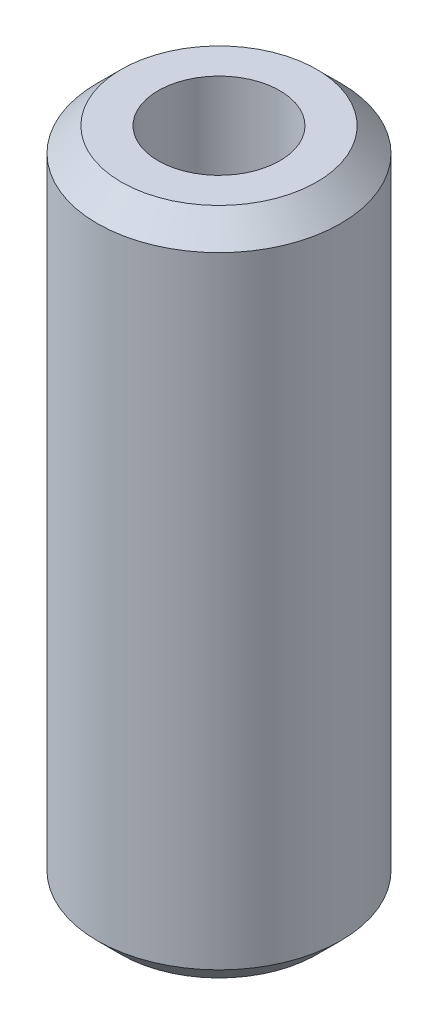
ISO-10303-21;
HEADER;
FILE_DESCRIPTION(('STEP AP214'),'2;1');
FILE_NAME('part.step','',(''),(''),'','','');
FILE_SCHEMA(('AUTOMOTIVE_DESIGN { 1 0 10303 214 1 1 1 1 }'));
ENDSEC;
DATA;
#1=APPLICATION_CONTEXT('core data for automotive mechanical design processes');
#2=APPLICATION_PROTOCOL_DEFINITION('international standard','automotive_design',2000,#1);
#3=PRODUCT_CONTEXT('',#1,'mechanical');
#4=PRODUCT('Part','Part','',(#3));
#5=PRODUCT_RELATED_PRODUCT_CATEGORY('part','',(#4));
#6=PRODUCT_DEFINITION_FORMATION('','',#4);
#7=PRODUCT_DEFINITION_CONTEXT('part definition',#1,'design');
#8=PRODUCT_DEFINITION('design','',#6,#7);
#9=PRODUCT_DEFINITION_SHAPE('','',#8);
#10=(LENGTH_UNIT() NAMED_UNIT(*) SI_UNIT(.MILLI.,.METRE.));
#11=(NAMED_UNIT(*) PLANE_ANGLE_UNIT() SI_UNIT($,.RADIAN.));
#12=(NAMED_UNIT(*) SI_UNIT($,.STERADIAN.) SOLID_ANGLE_UNIT());
#13=UNCERTAINTY_MEASURE_WITH_UNIT(LENGTH_MEASURE(1.E-05),#10,'distance_accuracy_value','');
#14=(GEOMETRIC_REPRESENTATION_CONTEXT(3) GLOBAL_UNCERTAINTY_ASSIGNED_CONTEXT((#13)) GLOBAL_UNIT_ASSIGNED_CONTEXT((#10,
#11,#12)) REPRESENTATION_CONTEXT('',''));
#15=CARTESIAN_POINT('',(0.,0.,0.));
#16=DIRECTION('',(0.,0.,1.));
#17=DIRECTION('',(1.,0.,0.));
#18=AXIS2_PLACEMENT_3D('',#15,#16,#17);
#19=CARTESIAN_POINT('',(0.,34.925,0.));
#20=DIRECTION('',(0.,1.,0.));
#21=DIRECTION('',(0.,0.,1.));
#22=AXIS2_PLACEMENT_3D('',#19,#20,#21);
#23=PLANE('',#22);
#24=CARTESIAN_POINT('',(0.,34.925,0.));
#25=DIRECTION('',(0.,1.,0.));
#26=DIRECTION('',(0.,0.,1.));
#27=AXIS2_PLACEMENT_3D('',#24,#25,#26);
#28=CIRCLE('',#27,10.2);
#29=CARTESIAN_POINT('',(0.,34.925,10.2));
#30=VERTEX_POINT('',#29);
#31=EDGE_CURVE('E10',#30,#30,#28,.T.);
#32=ORIENTED_EDGE('',*,*,#31,.T.);
#33=EDGE_LOOP('',(#32));
#34=FACE_BOUND('',#33,.T.);
#35=CARTESIAN_POINT('',(0.,34.925,0.));
#36=DIRECTION('',(0.,1.,0.));
#37=DIRECTION('',(0.,0.,1.));
#38=AXIS2_PLACEMENT_3D('',#35,#36,#37);
#39=CIRCLE('',#38,6.35);
#40=CARTESIAN_POINT('',(0.,34.925,6.35));
#41=VERTEX_POINT('',#40);
#42=EDGE_CURVE('E51',#41,#41,#39,.T.);
#43=ORIENTED_EDGE('',*,*,#42,.F.);
#44=EDGE_LOOP('',(#43));
#45=FACE_BOUND('',#44,.T.);
#46=ADVANCED_FACE('F31',(#34,#45),#23,.T.);
#47=CARTESIAN_POINT('',(0.,-34.925,0.));
#48=DIRECTION('',(0.,1.,0.));
#49=DIRECTION('',(0.,0.,1.));
#50=AXIS2_PLACEMENT_3D('',#47,#48,#49);
#51=PLANE('',#50);
#52=CARTESIAN_POINT('',(0.,-34.925,0.));
#53=DIRECTION('',(0.,1.,0.));
#54=DIRECTION('',(0.,0.,1.));
#55=AXIS2_PLACEMENT_3D('',#52,#53,#54);
#56=CIRCLE('',#55,10.2);
#57=CARTESIAN_POINT('',(0.,-34.925,10.2));
#58=VERTEX_POINT('',#57);
#59=EDGE_CURVE('E38',#58,#58,#56,.F.);
#60=ORIENTED_EDGE('',*,*,#59,.T.);
#61=EDGE_LOOP('',(#60));
#62=FACE_BOUND('',#61,.T.);
#63=CARTESIAN_POINT('',(0.,-34.925,0.));
#64=DIRECTION('',(0.,1.,0.));
#65=DIRECTION('',(0.,0.,1.));
#66=AXIS2_PLACEMENT_3D('',#63,#64,#65);
#67=CIRCLE('',#66,6.35);
#68=CARTESIAN_POINT('',(0.,-34.925,6.35));
#69=VERTEX_POINT('',#68);
#70=EDGE_CURVE('E52',#69,#69,#67,.T.);
#71=ORIENTED_EDGE('',*,*,#70,.T.);
#72=EDGE_LOOP('',(#71));
#73=FACE_BOUND('',#72,.T.);
#74=ADVANCED_FACE('F62',(#62,#73),#51,.F.);
#75=CARTESIAN_POINT('',(0.,34.925,0.));
#76=DIRECTION('',(0.,-1.,0.));
#77=DIRECTION('',(0.,0.,-1.));
#78=AXIS2_PLACEMENT_3D('',#75,#76,#77);
#79=CYLINDRICAL_SURFACE('',#78,12.7);
#80=CARTESIAN_POINT('',(0.,-32.425,0.));
#81=DIRECTION('',(0.,1.,0.));
#82=DIRECTION('',(0.,0.,1.));
#83=AXIS2_PLACEMENT_3D('',#80,#81,#82);
#84=CIRCLE('',#83,12.7);
#85=CARTESIAN_POINT('',(0.,-32.425,12.7));
#86=VERTEX_POINT('',#85);
#87=EDGE_CURVE('E42',#86,#86,#84,.T.);
#88=ORIENTED_EDGE('',*,*,#87,.T.);
#89=EDGE_LOOP('',(#88));
#90=FACE_BOUND('',#89,.T.);
#91=CARTESIAN_POINT('',(0.,32.425,0.));
#92=DIRECTION('',(0.,1.,0.));
#93=DIRECTION('',(0.,0.,1.));
#94=AXIS2_PLACEMENT_3D('',#91,#92,#93);
#95=CIRCLE('',#94,12.7);
#96=CARTESIAN_POINT('',(0.,32.425,12.7));
#97=VERTEX_POINT('',#96);
#98=EDGE_CURVE('E46',#97,#97,#95,.F.);
#99=ORIENTED_EDGE('',*,*,#98,.T.);
#100=EDGE_LOOP('',(#99));
#101=FACE_BOUND('',#100,.T.);
#102=ADVANCED_FACE('F67',(#90,#101),#79,.T.);
#103=CARTESIAN_POINT('',(0.,34.925,0.));
#104=DIRECTION('',(0.,-1.,0.));
#105=DIRECTION('',(0.,0.,-1.));
#106=AXIS2_PLACEMENT_3D('',#103,#104,#105);
#107=CYLINDRICAL_SURFACE('',#106,6.35);
#108=ORIENTED_EDGE('',*,*,#42,.T.);
#109=EDGE_LOOP('',(#108));
#110=FACE_BOUND('',#109,.T.);
#111=ORIENTED_EDGE('',*,*,#70,.F.);
#112=EDGE_LOOP('',(#111));
#113=FACE_BOUND('',#112,.T.);
#114=ADVANCED_FACE('F58',(#110,#113),#107,.F.);
#115=CARTESIAN_POINT('',(0.,-32.425,0.));
#116=DIRECTION('',(0.,1.,0.));
#117=DIRECTION('',(0.,0.,1.));
#118=AXIS2_PLACEMENT_3D('',#115,#116,#117);
#119=CONICAL_SURFACE('',#118,12.7,0.785398163397449);
#120=ORIENTED_EDGE('',*,*,#59,.F.);
#121=EDGE_LOOP('',(#120));
#122=FACE_BOUND('',#121,.T.);
#123=ORIENTED_EDGE('',*,*,#87,.F.);
#124=EDGE_LOOP('',(#123));
#125=FACE_BOUND('',#124,.T.);
#126=ADVANCED_FACE('F73',(#122,#125),#119,.T.);
#127=CARTESIAN_POINT('',(0.,34.925,0.));
#128=DIRECTION('',(0.,-1.,0.));
#129=DIRECTION('',(0.,0.,-1.));
#130=AXIS2_PLACEMENT_3D('',#127,#128,#129);
#131=CONICAL_SURFACE('',#130,10.2,0.785398163397446);
#132=ORIENTED_EDGE('',*,*,#98,.F.);
#133=EDGE_LOOP('',(#132));
#134=FACE_BOUND('',#133,.T.);
#135=ORIENTED_EDGE('',*,*,#31,.F.);
#136=EDGE_LOOP('',(#135));
#137=FACE_BOUND('',#136,.T.);
#138=ADVANCED_FACE('F33',(#134,#137),#131,.T.);
#139=CLOSED_SHELL('',(#46,#74,#102,#114,#126,#138));
#140=MANIFOLD_SOLID_BREP('B2',#139);
#141=ADVANCED_BREP_SHAPE_REPRESENTATION('',(#18,#140),#14);
#142=SHAPE_DEFINITION_REPRESENTATION(#9,#141);
ENDSEC;
END-ISO-10303-21;
